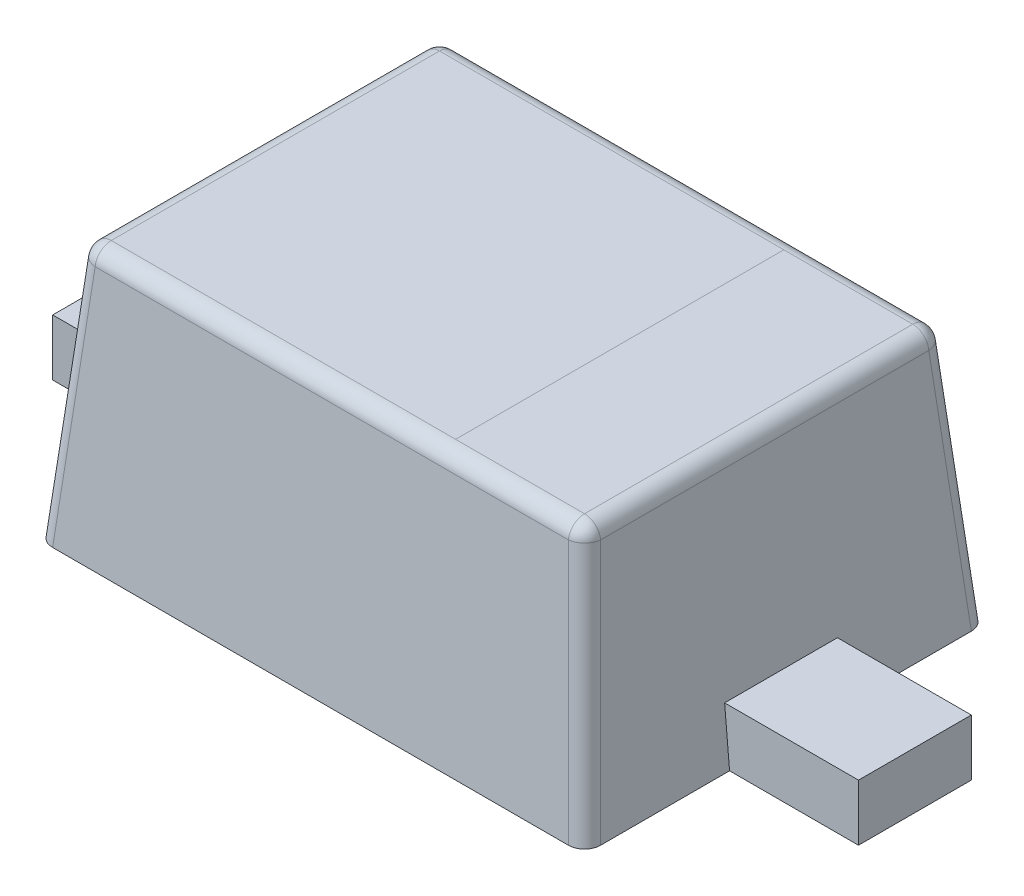
ISO-10303-21;
HEADER;
FILE_DESCRIPTION(('STEP AP214'),'2;1');
FILE_NAME('part.step','',(''),(''),'','','');
FILE_SCHEMA(('AUTOMOTIVE_DESIGN { 1 0 10303 214 1 1 1 1 }'));
ENDSEC;
DATA;
#1=APPLICATION_CONTEXT('core data for automotive mechanical design processes');
#2=APPLICATION_PROTOCOL_DEFINITION('international standard','automotive_design',2000,#1);
#3=PRODUCT_CONTEXT('',#1,'mechanical');
#4=PRODUCT('Part','Part','',(#3));
#5=PRODUCT_RELATED_PRODUCT_CATEGORY('part','',(#4));
#6=PRODUCT_DEFINITION_FORMATION('','',#4);
#7=PRODUCT_DEFINITION_CONTEXT('part definition',#1,'design');
#8=PRODUCT_DEFINITION('design','',#6,#7);
#9=PRODUCT_DEFINITION_SHAPE('','',#8);
#10=(LENGTH_UNIT() NAMED_UNIT(*) SI_UNIT(.MILLI.,.METRE.));
#11=(NAMED_UNIT(*) PLANE_ANGLE_UNIT() SI_UNIT($,.RADIAN.));
#12=(NAMED_UNIT(*) SI_UNIT($,.STERADIAN.) SOLID_ANGLE_UNIT());
#13=UNCERTAINTY_MEASURE_WITH_UNIT(LENGTH_MEASURE(1.E-05),#10,'distance_accuracy_value','');
#14=(GEOMETRIC_REPRESENTATION_CONTEXT(3) GLOBAL_UNCERTAINTY_ASSIGNED_CONTEXT((#13)) GLOBAL_UNIT_ASSIGNED_CONTEXT((#10,
#11,#12)) REPRESENTATION_CONTEXT('',''));
#15=CARTESIAN_POINT('',(0.,0.,0.));
#16=DIRECTION('',(0.,0.,1.));
#17=DIRECTION('',(1.,0.,0.));
#18=AXIS2_PLACEMENT_3D('',#15,#16,#17);
#19=CARTESIAN_POINT('',(-0.85,0.,0.625));
#20=DIRECTION('',(-0.996194698091746,0.0871557427476584,0.));
#21=DIRECTION('',(0.0617457854184492,0.705757556807952,0.705757556807952));
#22=AXIS2_PLACEMENT_3D('',#19,#20,#21);
#23=PLANE('',#22);
#24=DIRECTION('',(0.0871557427476584,0.996194698091745,0.));
#25=VECTOR('',#24,1.);
#26=CARTESIAN_POINT('',(-0.85,0.,0.175));
#27=LINE('',#26,#25);
#28=CARTESIAN_POINT('',(-0.85,0.,0.175));
#29=VERTEX_POINT('',#28);
#30=CARTESIAN_POINT('',(-0.834689483882963,0.175,0.175));
#31=VERTEX_POINT('',#30);
#32=EDGE_CURVE('E34',#29,#31,#27,.T.);
#33=ORIENTED_EDGE('',*,*,#32,.F.);
#34=DIRECTION('',(0.,0.,1.));
#35=VECTOR('',#34,1.);
#36=CARTESIAN_POINT('',(-0.85,0.,0.625));
#37=LINE('',#36,#35);
#38=CARTESIAN_POINT('',(-0.85,0.,0.575190265095413));
#39=VERTEX_POINT('',#38);
#40=EDGE_CURVE('E11',#29,#39,#37,.T.);
#41=ORIENTED_EDGE('',*,*,#40,.T.);
#42=DIRECTION('',(0.0868265938642478,0.992432509138967,-0.0868265938642478));
#43=VECTOR('',#42,1.);
#44=CARTESIAN_POINT('',(-0.850375508488681,-0.00429208166574834,0.575565773584093));
#45=LINE('',#44,#43);
#46=CARTESIAN_POINT('',(-0.784002245382977,0.754357787137383,0.50919251047839));
#47=VERTEX_POINT('',#46);
#48=EDGE_CURVE('E26',#39,#47,#45,.T.);
#49=ORIENTED_EDGE('',*,*,#48,.T.);
#50=DIRECTION('',(0.,0.,-1.));
#51=VECTOR('',#50,1.);
#52=CARTESIAN_POINT('',(-0.784002245382977,0.754357787137383,-0.555009069179261));
#53=LINE('',#52,#51);
#54=CARTESIAN_POINT('',(-0.784002245382977,0.754357787137383,-0.50919251047839));
#55=VERTEX_POINT('',#54);
#56=EDGE_CURVE('E317',#47,#55,#53,.T.);
#57=ORIENTED_EDGE('',*,*,#56,.T.);
#58=DIRECTION('',(-0.0868265938642478,-0.992432509138967,-0.0868265938642478));
#59=VECTOR('',#58,1.);
#60=CARTESIAN_POINT('',(-0.840951936736097,0.103419836345108,-0.56614220183151));
#61=LINE('',#60,#59);
#62=CARTESIAN_POINT('',(-0.85,0.,-0.575190265095413));
#63=VERTEX_POINT('',#62);
#64=EDGE_CURVE('E314',#55,#63,#61,.T.);
#65=ORIENTED_EDGE('',*,*,#64,.T.);
#66=DIRECTION('',(0.,0.,1.));
#67=VECTOR('',#66,1.);
#68=CARTESIAN_POINT('',(-0.85,0.,0.625));
#69=LINE('',#68,#67);
#70=CARTESIAN_POINT('',(-0.85,0.,-0.175));
#71=VERTEX_POINT('',#70);
#72=EDGE_CURVE('E310',#63,#71,#69,.T.);
#73=ORIENTED_EDGE('',*,*,#72,.T.);
#74=DIRECTION('',(-0.0871557427476584,-0.996194698091745,0.));
#75=VECTOR('',#74,1.);
#76=CARTESIAN_POINT('',(-0.85,0.,-0.175));
#77=LINE('',#76,#75);
#78=CARTESIAN_POINT('',(-0.834689483882963,0.175,-0.175));
#79=VERTEX_POINT('',#78);
#80=EDGE_CURVE('E166',#79,#71,#77,.T.);
#81=ORIENTED_EDGE('',*,*,#80,.F.);
#82=DIRECTION('',(0.,0.,1.));
#83=VECTOR('',#82,1.);
#84=CARTESIAN_POINT('',(-0.834689483882963,0.175,0.625));
#85=LINE('',#84,#83);
#86=EDGE_CURVE('E308',#79,#31,#85,.T.);
#87=ORIENTED_EDGE('',*,*,#86,.T.);
#88=EDGE_LOOP('',(#33,#41,#49,#57,#65,#73,#81,#87));
#89=FACE_BOUND('',#88,.T.);
#90=ADVANCED_FACE('F16',(#89),#23,.T.);
#91=CARTESIAN_POINT('',(0.85,0.,0.625));
#92=DIRECTION('',(0.996194698091746,0.0871557427476584,0.));
#93=DIRECTION('',(-0.0617457854184492,0.705757556807952,0.705757556807952));
#94=AXIS2_PLACEMENT_3D('',#91,#92,#93);
#95=PLANE('',#94);
#96=DIRECTION('',(0.0871557427476584,-0.996194698091745,0.));
#97=VECTOR('',#96,1.);
#98=CARTESIAN_POINT('',(0.85,0.,0.175));
#99=LINE('',#98,#97);
#100=CARTESIAN_POINT('',(0.834689483882963,0.175,0.175));
#101=VERTEX_POINT('',#100);
#102=CARTESIAN_POINT('',(0.85,0.,0.175));
#103=VERTEX_POINT('',#102);
#104=EDGE_CURVE('E191',#101,#103,#99,.T.);
#105=ORIENTED_EDGE('',*,*,#104,.F.);
#106=DIRECTION('',(0.,0.,-1.));
#107=VECTOR('',#106,1.);
#108=CARTESIAN_POINT('',(0.834689483882963,0.175,0.625));
#109=LINE('',#108,#107);
#110=CARTESIAN_POINT('',(0.834689483882963,0.175,-0.175));
#111=VERTEX_POINT('',#110);
#112=EDGE_CURVE('E304',#101,#111,#109,.T.);
#113=ORIENTED_EDGE('',*,*,#112,.T.);
#114=DIRECTION('',(-0.0871557427476584,0.996194698091745,0.));
#115=VECTOR('',#114,1.);
#116=CARTESIAN_POINT('',(0.85,0.,-0.175));
#117=LINE('',#116,#115);
#118=CARTESIAN_POINT('',(0.85,0.,-0.175));
#119=VERTEX_POINT('',#118);
#120=EDGE_CURVE('E190',#119,#111,#117,.T.);
#121=ORIENTED_EDGE('',*,*,#120,.F.);
#122=DIRECTION('',(0.,0.,-1.));
#123=VECTOR('',#122,1.);
#124=CARTESIAN_POINT('',(0.85,0.,0.625));
#125=LINE('',#124,#123);
#126=CARTESIAN_POINT('',(0.85,0.,-0.575190265095413));
#127=VERTEX_POINT('',#126);
#128=EDGE_CURVE('E301',#119,#127,#125,.T.);
#129=ORIENTED_EDGE('',*,*,#128,.T.);
#130=DIRECTION('',(-0.0868265938642478,0.992432509138967,0.0868265938642478));
#131=VECTOR('',#130,1.);
#132=CARTESIAN_POINT('',(0.840951936736097,0.103419836345108,-0.56614220183151));
#133=LINE('',#132,#131);
#134=CARTESIAN_POINT('',(0.784002245382977,0.754357787137383,-0.50919251047839));
#135=VERTEX_POINT('',#134);
#136=EDGE_CURVE('E298',#127,#135,#133,.T.);
#137=ORIENTED_EDGE('',*,*,#136,.T.);
#138=DIRECTION('',(0.,0.,1.));
#139=VECTOR('',#138,1.);
#140=CARTESIAN_POINT('',(0.784002245382977,0.754357787137383,0.555009069179261));
#141=LINE('',#140,#139);
#142=CARTESIAN_POINT('',(0.784002245382977,0.754357787137383,0.509192510478389));
#143=VERTEX_POINT('',#142);
#144=EDGE_CURVE('E295',#135,#143,#141,.T.);
#145=ORIENTED_EDGE('',*,*,#144,.T.);
#146=DIRECTION('',(0.0868265938642478,-0.992432509138967,0.0868265938642478));
#147=VECTOR('',#146,1.);
#148=CARTESIAN_POINT('',(0.850375508488681,-0.00429208166574833,0.575565773584093));
#149=LINE('',#148,#147);
#150=CARTESIAN_POINT('',(0.85,0.,0.575190265095413));
#151=VERTEX_POINT('',#150);
#152=EDGE_CURVE('E292',#143,#151,#149,.T.);
#153=ORIENTED_EDGE('',*,*,#152,.T.);
#154=DIRECTION('',(0.,0.,-1.));
#155=VECTOR('',#154,1.);
#156=CARTESIAN_POINT('',(0.85,0.,0.625));
#157=LINE('',#156,#155);
#158=EDGE_CURVE('E289',#151,#103,#157,.T.);
#159=ORIENTED_EDGE('',*,*,#158,.T.);
#160=EDGE_LOOP('',(#105,#113,#121,#129,#137,#145,#153,#159));
#161=FACE_BOUND('',#160,.T.);
#162=ADVANCED_FACE('F351',(#161),#95,.T.);
#163=CARTESIAN_POINT('',(0.,0.8,0.));
#164=DIRECTION('',(0.,1.,0.));
#165=DIRECTION('',(0.707106781186548,0.,0.707106781186548));
#166=AXIS2_PLACEMENT_3D('',#163,#164,#165);
#167=PLANE('',#166);
#168=DIRECTION('',(1.,0.,0.));
#169=VECTOR('',#168,1.);
#170=CARTESIAN_POINT('',(0.780009069179261,0.8,0.509192510478389));
#171=LINE('',#170,#169);
#172=CARTESIAN_POINT('',(-0.734192510478389,0.8,0.50919251047839));
#173=VERTEX_POINT('',#172);
#174=CARTESIAN_POINT('',(0.334192510478389,0.8,0.509192510478389));
#175=VERTEX_POINT('',#174);
#176=EDGE_CURVE('E286',#173,#175,#171,.T.);
#177=ORIENTED_EDGE('',*,*,#176,.T.);
#178=DIRECTION('',(0.,0.,-1.));
#179=VECTOR('',#178,1.);
#180=CARTESIAN_POINT('',(0.334192510478389,0.8,0.));
#181=LINE('',#180,#179);
#182=CARTESIAN_POINT('',(0.334192510478389,0.8,-0.50919251047839));
#183=VERTEX_POINT('',#182);
#184=EDGE_CURVE('E283',#175,#183,#181,.T.);
#185=ORIENTED_EDGE('',*,*,#184,.T.);
#186=DIRECTION('',(-1.,0.,0.));
#187=VECTOR('',#186,1.);
#188=CARTESIAN_POINT('',(-0.780009069179261,0.8,-0.50919251047839));
#189=LINE('',#188,#187);
#190=CARTESIAN_POINT('',(-0.734192510478389,0.8,-0.50919251047839));
#191=VERTEX_POINT('',#190);
#192=EDGE_CURVE('E280',#183,#191,#189,.T.);
#193=ORIENTED_EDGE('',*,*,#192,.T.);
#194=DIRECTION('',(0.,0.,1.));
#195=VECTOR('',#194,1.);
#196=CARTESIAN_POINT('',(-0.734192510478389,0.8,0.555009069179261));
#197=LINE('',#196,#195);
#198=EDGE_CURVE('E277',#191,#173,#197,.T.);
#199=ORIENTED_EDGE('',*,*,#198,.T.);
#200=EDGE_LOOP('',(#177,#185,#193,#199));
#201=FACE_BOUND('',#200,.T.);
#202=ADVANCED_FACE('F356',(#201),#167,.T.);
#203=CARTESIAN_POINT('',(0.85,0.,0.625));
#204=DIRECTION('',(0.,0.0871557427476584,0.996194698091746));
#205=DIRECTION('',(0.705757556807952,0.705757556807952,-0.0617457854184493));
#206=AXIS2_PLACEMENT_3D('',#203,#204,#205);
#207=PLANE('',#206);
#208=DIRECTION('',(-1.,0.,0.));
#209=VECTOR('',#208,1.);
#210=CARTESIAN_POINT('',(-0.780009069179261,0.754357787137383,0.559002245382977));
#211=LINE('',#210,#209);
#212=CARTESIAN_POINT('',(0.734192510478389,0.754357787137383,0.559002245382977));
#213=VERTEX_POINT('',#212);
#214=CARTESIAN_POINT('',(-0.734192510478389,0.754357787137383,0.559002245382977));
#215=VERTEX_POINT('',#214);
#216=EDGE_CURVE('E274',#213,#215,#211,.T.);
#217=ORIENTED_EDGE('',*,*,#216,.T.);
#218=DIRECTION('',(-0.0868265938642478,-0.992432509138967,0.0868265938642478));
#219=VECTOR('',#218,1.);
#220=CARTESIAN_POINT('',(-0.787749716000579,0.142196126829017,0.612559450905167));
#221=LINE('',#220,#219);
#222=CARTESIAN_POINT('',(-0.800190265095413,0.,0.625));
#223=VERTEX_POINT('',#222);
#224=EDGE_CURVE('E271',#215,#223,#221,.T.);
#225=ORIENTED_EDGE('',*,*,#224,.T.);
#226=DIRECTION('',(1.,0.,0.));
#227=VECTOR('',#226,1.);
#228=CARTESIAN_POINT('',(0.85,0.,0.625));
#229=LINE('',#228,#227);
#230=CARTESIAN_POINT('',(0.800190265095413,0.,0.625));
#231=VERTEX_POINT('',#230);
#232=EDGE_CURVE('E268',#223,#231,#229,.T.);
#233=ORIENTED_EDGE('',*,*,#232,.T.);
#234=DIRECTION('',(-0.0868265938642478,0.992432509138967,-0.0868265938642478));
#235=VECTOR('',#234,1.);
#236=CARTESIAN_POINT('',(0.800565773584093,-0.00429208166574833,0.62537550848868));
#237=LINE('',#236,#235);
#238=EDGE_CURVE('E265',#231,#213,#237,.T.);
#239=ORIENTED_EDGE('',*,*,#238,.T.);
#240=EDGE_LOOP('',(#217,#225,#233,#239));
#241=FACE_BOUND('',#240,.T.);
#242=ADVANCED_FACE('F362',(#241),#207,.T.);
#243=CARTESIAN_POINT('',(0.85,0.,-0.625));
#244=DIRECTION('',(0.,0.0871557427476584,-0.996194698091746));
#245=DIRECTION('',(0.705757556807952,0.705757556807952,0.0617457854184491));
#246=AXIS2_PLACEMENT_3D('',#243,#244,#245);
#247=PLANE('',#246);
#248=DIRECTION('',(-1.,0.,0.));
#249=VECTOR('',#248,1.);
#250=CARTESIAN_POINT('',(0.85,0.,-0.625));
#251=LINE('',#250,#249);
#252=CARTESIAN_POINT('',(0.800190265095413,0.,-0.625));
#253=VERTEX_POINT('',#252);
#254=CARTESIAN_POINT('',(-0.800190265095413,0.,-0.625));
#255=VERTEX_POINT('',#254);
#256=EDGE_CURVE('E262',#253,#255,#251,.T.);
#257=ORIENTED_EDGE('',*,*,#256,.T.);
#258=DIRECTION('',(0.0868265938642478,0.992432509138967,0.0868265938642478));
#259=VECTOR('',#258,1.);
#260=CARTESIAN_POINT('',(-0.787749716000579,0.142196126829017,-0.612559450905167));
#261=LINE('',#260,#259);
#262=CARTESIAN_POINT('',(-0.734192510478389,0.754357787137383,-0.559002245382977));
#263=VERTEX_POINT('',#262);
#264=EDGE_CURVE('E259',#255,#263,#261,.T.);
#265=ORIENTED_EDGE('',*,*,#264,.T.);
#266=DIRECTION('',(1.,0.,0.));
#267=VECTOR('',#266,1.);
#268=CARTESIAN_POINT('',(0.780009069179261,0.754357787137383,-0.559002245382977));
#269=LINE('',#268,#267);
#270=CARTESIAN_POINT('',(0.734192510478389,0.754357787137383,-0.559002245382977));
#271=VERTEX_POINT('',#270);
#272=EDGE_CURVE('E256',#263,#271,#269,.T.);
#273=ORIENTED_EDGE('',*,*,#272,.T.);
#274=DIRECTION('',(0.0868265938642478,-0.992432509138967,-0.0868265938642478));
#275=VECTOR('',#274,1.);
#276=CARTESIAN_POINT('',(0.800565773584093,-0.00429208166574834,-0.625375508488681));
#277=LINE('',#276,#275);
#278=EDGE_CURVE('E254',#271,#253,#277,.T.);
#279=ORIENTED_EDGE('',*,*,#278,.T.);
#280=EDGE_LOOP('',(#257,#265,#273,#279));
#281=FACE_BOUND('',#280,.T.);
#282=ADVANCED_FACE('F366',(#281),#247,.T.);
#283=CARTESIAN_POINT('',(0.,0.8,0.));
#284=DIRECTION('',(0.,1.,0.));
#285=DIRECTION('',(0.707106781186548,0.,0.707106781186548));
#286=AXIS2_PLACEMENT_3D('',#283,#284,#285);
#287=PLANE('',#286);
#288=ORIENTED_EDGE('',*,*,#184,.F.);
#289=DIRECTION('',(1.,0.,0.));
#290=VECTOR('',#289,1.);
#291=CARTESIAN_POINT('',(0.780009069179261,0.8,0.509192510478389));
#292=LINE('',#291,#290);
#293=CARTESIAN_POINT('',(0.734192510478389,0.8,0.509192510478389));
#294=VERTEX_POINT('',#293);
#295=EDGE_CURVE('E251',#175,#294,#292,.T.);
#296=ORIENTED_EDGE('',*,*,#295,.T.);
#297=DIRECTION('',(0.,0.,-1.));
#298=VECTOR('',#297,1.);
#299=CARTESIAN_POINT('',(0.734192510478389,0.8,-0.555009069179261));
#300=LINE('',#299,#298);
#301=CARTESIAN_POINT('',(0.734192510478389,0.8,-0.50919251047839));
#302=VERTEX_POINT('',#301);
#303=EDGE_CURVE('E248',#294,#302,#300,.T.);
#304=ORIENTED_EDGE('',*,*,#303,.T.);
#305=DIRECTION('',(-1.,0.,0.));
#306=VECTOR('',#305,1.);
#307=CARTESIAN_POINT('',(-0.780009069179261,0.8,-0.50919251047839));
#308=LINE('',#307,#306);
#309=EDGE_CURVE('E240',#302,#183,#308,.T.);
#310=ORIENTED_EDGE('',*,*,#309,.T.);
#311=EDGE_LOOP('',(#288,#296,#304,#310));
#312=FACE_BOUND('',#311,.T.);
#313=ADVANCED_FACE('F370',(#312),#287,.T.);
#314=CARTESIAN_POINT('',(0.,0.,0.));
#315=DIRECTION('',(0.,1.,0.));
#316=DIRECTION('',(0.707106781186548,0.,0.707106781186548));
#317=AXIS2_PLACEMENT_3D('',#314,#315,#316);
#318=PLANE('',#317);
#319=ORIENTED_EDGE('',*,*,#128,.F.);
#320=DIRECTION('',(-1.,0.,0.));
#321=VECTOR('',#320,1.);
#322=CARTESIAN_POINT('',(1.25,0.,-0.175));
#323=LINE('',#322,#321);
#324=CARTESIAN_POINT('',(1.25,0.,-0.175));
#325=VERTEX_POINT('',#324);
#326=EDGE_CURVE('E177',#325,#119,#323,.T.);
#327=ORIENTED_EDGE('',*,*,#326,.F.);
#328=DIRECTION('',(0.,0.,-1.));
#329=VECTOR('',#328,1.);
#330=CARTESIAN_POINT('',(1.25,0.,0.175));
#331=LINE('',#330,#329);
#332=CARTESIAN_POINT('',(1.25,0.,0.175));
#333=VERTEX_POINT('',#332);
#334=EDGE_CURVE('E184',#333,#325,#331,.T.);
#335=ORIENTED_EDGE('',*,*,#334,.F.);
#336=DIRECTION('',(1.,0.,0.));
#337=VECTOR('',#336,1.);
#338=CARTESIAN_POINT('',(1.25,0.,0.175));
#339=LINE('',#338,#337);
#340=EDGE_CURVE('E172',#103,#333,#339,.T.);
#341=ORIENTED_EDGE('',*,*,#340,.F.);
#342=ORIENTED_EDGE('',*,*,#158,.F.);
#343=CARTESIAN_POINT('',(0.799809008122833,0.,0.574809008122832));
#344=DIRECTION('',(0.,-1.,0.));
#345=DIRECTION('',(0.707106781186547,0.,0.707106781186548));
#346=AXIS2_PLACEMENT_3D('',#343,#344,#345);
#347=ELLIPSE('',#346,0.0503812597225175,0.05);
#348=EDGE_CURVE('E237',#151,#231,#347,.T.);
#349=ORIENTED_EDGE('',*,*,#348,.T.);
#350=ORIENTED_EDGE('',*,*,#232,.F.);
#351=CARTESIAN_POINT('',(-0.799809008122833,0.,0.574809008122833));
#352=DIRECTION('',(0.,-1.,0.));
#353=DIRECTION('',(0.707106781186548,0.,-0.707106781186547));
#354=AXIS2_PLACEMENT_3D('',#351,#352,#353);
#355=ELLIPSE('',#354,0.0503812597225175,0.05);
#356=EDGE_CURVE('E230',#223,#39,#355,.T.);
#357=ORIENTED_EDGE('',*,*,#356,.T.);
#358=ORIENTED_EDGE('',*,*,#40,.F.);
#359=DIRECTION('',(1.,0.,0.));
#360=VECTOR('',#359,1.);
#361=CARTESIAN_POINT('',(1.25,0.,0.175));
#362=LINE('',#361,#360);
#363=CARTESIAN_POINT('',(-1.25,0.,0.175));
#364=VERTEX_POINT('',#363);
#365=EDGE_CURVE('E157',#364,#29,#362,.T.);
#366=ORIENTED_EDGE('',*,*,#365,.F.);
#367=DIRECTION('',(0.,0.,1.));
#368=VECTOR('',#367,1.);
#369=CARTESIAN_POINT('',(-1.25,0.,0.175));
#370=LINE('',#369,#368);
#371=CARTESIAN_POINT('',(-1.25,0.,-0.175));
#372=VERTEX_POINT('',#371);
#373=EDGE_CURVE('E164',#372,#364,#370,.T.);
#374=ORIENTED_EDGE('',*,*,#373,.F.);
#375=DIRECTION('',(-1.,0.,0.));
#376=VECTOR('',#375,1.);
#377=CARTESIAN_POINT('',(1.25,0.,-0.175));
#378=LINE('',#377,#376);
#379=EDGE_CURVE('E168',#71,#372,#378,.T.);
#380=ORIENTED_EDGE('',*,*,#379,.F.);
#381=ORIENTED_EDGE('',*,*,#72,.F.);
#382=CARTESIAN_POINT('',(-0.799809008122833,0.,-0.574809008122833));
#383=DIRECTION('',(0.,-1.,0.));
#384=DIRECTION('',(0.707106781186547,0.,0.707106781186548));
#385=AXIS2_PLACEMENT_3D('',#382,#383,#384);
#386=ELLIPSE('',#385,0.0503812597225175,0.05);
#387=EDGE_CURVE('E227',#63,#255,#386,.T.);
#388=ORIENTED_EDGE('',*,*,#387,.T.);
#389=ORIENTED_EDGE('',*,*,#256,.F.);
#390=CARTESIAN_POINT('',(0.799809008122833,0.,-0.574809008122833));
#391=DIRECTION('',(0.,-1.,0.));
#392=DIRECTION('',(0.707106781186548,0.,-0.707106781186547));
#393=AXIS2_PLACEMENT_3D('',#390,#391,#392);
#394=ELLIPSE('',#393,0.0503812597225175,0.05);
#395=EDGE_CURVE('E222',#253,#127,#394,.T.);
#396=ORIENTED_EDGE('',*,*,#395,.T.);
#397=EDGE_LOOP('',(#319,#327,#335,#341,#342,#349,#350,#357,#358,#366,#374,#380,#381,#388,#389,#396));
#398=FACE_BOUND('',#397,.T.);
#399=ADVANCED_FACE('F340',(#398),#318,.F.);
#400=CARTESIAN_POINT('',(0.800565773584093,-0.00864986880313126,0.575565773584093));
#401=DIRECTION('',(0.0868265938642478,-0.992432509138967,0.0868265938642478));
#402=DIRECTION('',(0.996194698091746,0.0871557427476584,0.));
#403=AXIS2_PLACEMENT_3D('',#400,#401,#402);
#404=CYLINDRICAL_SURFACE('',#403,0.05);
#405=ORIENTED_EDGE('',*,*,#348,.F.);
#406=ORIENTED_EDGE('',*,*,#152,.F.);
#407=CARTESIAN_POINT('',(0.734192510478389,0.75,0.509192510478389));
#408=DIRECTION('',(-0.0868265938642477,0.992432509138967,-0.0868265938642477));
#409=DIRECTION('',(0.,0.0871557427476582,0.996194698091746));
#410=AXIS2_PLACEMENT_3D('',#407,#408,#409);
#411=CIRCLE('',#410,0.05);
#412=EDGE_CURVE('E218',#213,#143,#411,.T.);
#413=ORIENTED_EDGE('',*,*,#412,.F.);
#414=ORIENTED_EDGE('',*,*,#238,.F.);
#415=EDGE_LOOP('',(#405,#406,#413,#414));
#416=FACE_BOUND('',#415,.T.);
#417=ADVANCED_FACE('F377',(#416),#404,.T.);
#418=CARTESIAN_POINT('',(0.,0.75,0.509192510478389));
#419=DIRECTION('',(1.,0.,0.));
#420=DIRECTION('',(0.,0.,-1.));
#421=AXIS2_PLACEMENT_3D('',#418,#419,#420);
#422=CYLINDRICAL_SURFACE('',#421,0.05);
#423=CARTESIAN_POINT('',(-0.734192510478389,0.75,0.50919251047839));
#424=DIRECTION('',(-1.,0.,0.));
#425=DIRECTION('',(0.,0.,1.));
#426=AXIS2_PLACEMENT_3D('',#423,#424,#425);
#427=CIRCLE('',#426,0.05);
#428=EDGE_CURVE('E214',#215,#173,#427,.T.);
#429=ORIENTED_EDGE('',*,*,#428,.F.);
#430=ORIENTED_EDGE('',*,*,#216,.F.);
#431=CARTESIAN_POINT('',(0.734192510478389,0.75,0.509192510478389));
#432=DIRECTION('',(1.,0.,0.));
#433=DIRECTION('',(0.,0.,-1.));
#434=AXIS2_PLACEMENT_3D('',#431,#432,#433);
#435=CIRCLE('',#434,0.05);
#436=EDGE_CURVE('E219',#294,#213,#435,.T.);
#437=ORIENTED_EDGE('',*,*,#436,.F.);
#438=ORIENTED_EDGE('',*,*,#295,.F.);
#439=ORIENTED_EDGE('',*,*,#176,.F.);
#440=EDGE_LOOP('',(#429,#430,#437,#438,#439));
#441=FACE_BOUND('',#440,.T.);
#442=ADVANCED_FACE('F380',(#441),#422,.T.);
#443=CARTESIAN_POINT('',(-0.787749716000579,0.137838339691634,0.562749716000579));
#444=DIRECTION('',(-0.0868265938642478,-0.992432509138967,0.0868265938642478));
#445=DIRECTION('',(0.,-0.0871557427476584,-0.996194698091746));
#446=AXIS2_PLACEMENT_3D('',#443,#444,#445);
#447=CYLINDRICAL_SURFACE('',#446,0.05);
#448=ORIENTED_EDGE('',*,*,#356,.F.);
#449=ORIENTED_EDGE('',*,*,#224,.F.);
#450=CARTESIAN_POINT('',(-0.734192510478389,0.75,0.50919251047839));
#451=DIRECTION('',(0.0868265938642477,0.992432509138967,-0.0868265938642475));
#452=DIRECTION('',(-0.996194698091746,0.0871557427476582,0.));
#453=AXIS2_PLACEMENT_3D('',#450,#451,#452);
#454=CIRCLE('',#453,0.05);
#455=EDGE_CURVE('E215',#47,#215,#454,.T.);
#456=ORIENTED_EDGE('',*,*,#455,.F.);
#457=ORIENTED_EDGE('',*,*,#48,.F.);
#458=EDGE_LOOP('',(#448,#449,#456,#457));
#459=FACE_BOUND('',#458,.T.);
#460=ADVANCED_FACE('F384',(#459),#447,.T.);
#461=CARTESIAN_POINT('',(0.734192510478389,0.75,0.509192510478389));
#462=DIRECTION('',(0.,0.,1.));
#463=DIRECTION('',(1.,0.,0.));
#464=AXIS2_PLACEMENT_3D('',#461,#462,#463);
#465=SPHERICAL_SURFACE('',#464,0.05);
#466=ORIENTED_EDGE('',*,*,#436,.T.);
#467=ORIENTED_EDGE('',*,*,#412,.T.);
#468=CARTESIAN_POINT('',(0.734192510478389,0.75,0.509192510478389));
#469=DIRECTION('',(0.,0.,-1.));
#470=DIRECTION('',(0.,-1.,0.));
#471=AXIS2_PLACEMENT_3D('',#468,#469,#470);
#472=CIRCLE('',#471,0.05);
#473=EDGE_CURVE('E211',#294,#143,#472,.T.);
#474=ORIENTED_EDGE('',*,*,#473,.F.);
#475=EDGE_LOOP('',(#466,#467,#474));
#476=FACE_BOUND('',#475,.T.);
#477=ADVANCED_FACE('F388',(#476),#465,.T.);
#478=CARTESIAN_POINT('',(-0.734192510478389,0.75,0.50919251047839));
#479=DIRECTION('',(0.,0.,1.));
#480=DIRECTION('',(1.,0.,0.));
#481=AXIS2_PLACEMENT_3D('',#478,#479,#480);
#482=SPHERICAL_SURFACE('',#481,0.05);
#483=ORIENTED_EDGE('',*,*,#455,.T.);
#484=ORIENTED_EDGE('',*,*,#428,.T.);
#485=CARTESIAN_POINT('',(-0.734192510478389,0.75,0.50919251047839));
#486=DIRECTION('',(0.,0.,-1.));
#487=DIRECTION('',(1.,0.,0.));
#488=AXIS2_PLACEMENT_3D('',#485,#486,#487);
#489=CIRCLE('',#488,0.05);
#490=EDGE_CURVE('E207',#47,#173,#489,.T.);
#491=ORIENTED_EDGE('',*,*,#490,.F.);
#492=EDGE_LOOP('',(#483,#484,#491));
#493=FACE_BOUND('',#492,.T.);
#494=ADVANCED_FACE('F326',(#493),#482,.T.);
#495=CARTESIAN_POINT('',(0.800565773584093,-0.00864986880313126,-0.575565773584093));
#496=DIRECTION('',(0.0868265938642478,-0.992432509138967,-0.0868265938642478));
#497=DIRECTION('',(0.,0.0871557427476584,-0.996194698091746));
#498=AXIS2_PLACEMENT_3D('',#495,#496,#497);
#499=CYLINDRICAL_SURFACE('',#498,0.05);
#500=ORIENTED_EDGE('',*,*,#395,.F.);
#501=ORIENTED_EDGE('',*,*,#278,.F.);
#502=CARTESIAN_POINT('',(0.734192510478389,0.75,-0.50919251047839));
#503=DIRECTION('',(-0.0868265938642477,0.992432509138967,0.0868265938642475));
#504=DIRECTION('',(-0.996194698091746,-0.0871557427476582,0.));
#505=AXIS2_PLACEMENT_3D('',#502,#503,#504);
#506=CIRCLE('',#505,0.05);
#507=EDGE_CURVE('E202',#135,#271,#506,.T.);
#508=ORIENTED_EDGE('',*,*,#507,.F.);
#509=ORIENTED_EDGE('',*,*,#136,.F.);
#510=EDGE_LOOP('',(#500,#501,#508,#509));
#511=FACE_BOUND('',#510,.T.);
#512=ADVANCED_FACE('F394',(#511),#499,.T.);
#513=CARTESIAN_POINT('',(0.734192510478389,0.75,0.));
#514=DIRECTION('',(0.,0.,-1.));
#515=DIRECTION('',(-1.,0.,0.));
#516=AXIS2_PLACEMENT_3D('',#513,#514,#515);
#517=CYLINDRICAL_SURFACE('',#516,0.05);
#518=ORIENTED_EDGE('',*,*,#473,.T.);
#519=ORIENTED_EDGE('',*,*,#144,.F.);
#520=CARTESIAN_POINT('',(0.734192510478389,0.75,-0.50919251047839));
#521=DIRECTION('',(0.,0.,-1.));
#522=DIRECTION('',(-1.,0.,0.));
#523=AXIS2_PLACEMENT_3D('',#520,#521,#522);
#524=CIRCLE('',#523,0.05);
#525=EDGE_CURVE('E204',#302,#135,#524,.T.);
#526=ORIENTED_EDGE('',*,*,#525,.F.);
#527=ORIENTED_EDGE('',*,*,#303,.F.);
#528=EDGE_LOOP('',(#518,#519,#526,#527));
#529=FACE_BOUND('',#528,.T.);
#530=ADVANCED_FACE('F397',(#529),#517,.T.);
#531=CARTESIAN_POINT('',(-0.734192510478389,0.75,0.));
#532=DIRECTION('',(0.,0.,1.));
#533=DIRECTION('',(1.,0.,0.));
#534=AXIS2_PLACEMENT_3D('',#531,#532,#533);
#535=CYLINDRICAL_SURFACE('',#534,0.05);
#536=ORIENTED_EDGE('',*,*,#490,.T.);
#537=ORIENTED_EDGE('',*,*,#198,.F.);
#538=CARTESIAN_POINT('',(-0.734192510478389,0.75,-0.50919251047839));
#539=DIRECTION('',(0.,0.,-1.));
#540=DIRECTION('',(0.,1.,0.));
#541=AXIS2_PLACEMENT_3D('',#538,#539,#540);
#542=CIRCLE('',#541,0.05);
#543=EDGE_CURVE('E198',#55,#191,#542,.T.);
#544=ORIENTED_EDGE('',*,*,#543,.F.);
#545=ORIENTED_EDGE('',*,*,#56,.F.);
#546=EDGE_LOOP('',(#536,#537,#544,#545));
#547=FACE_BOUND('',#546,.T.);
#548=ADVANCED_FACE('F329',(#547),#535,.T.);
#549=CARTESIAN_POINT('',(-0.791142201831509,0.0990620492077256,-0.56614220183151));
#550=DIRECTION('',(-0.0868265938642478,-0.992432509138967,-0.0868265938642478));
#551=DIRECTION('',(0.996194698091746,-0.0871557427476584,0.));
#552=AXIS2_PLACEMENT_3D('',#549,#550,#551);
#553=CYLINDRICAL_SURFACE('',#552,0.05);
#554=ORIENTED_EDGE('',*,*,#387,.F.);
#555=ORIENTED_EDGE('',*,*,#64,.F.);
#556=CARTESIAN_POINT('',(-0.734192510478389,0.75,-0.50919251047839));
#557=DIRECTION('',(0.0868265938642473,0.992432509138967,0.0868265938642477));
#558=DIRECTION('',(0.,-0.0871557427476582,0.996194698091746));
#559=AXIS2_PLACEMENT_3D('',#556,#557,#558);
#560=CIRCLE('',#559,0.05);
#561=EDGE_CURVE('E199',#263,#55,#560,.T.);
#562=ORIENTED_EDGE('',*,*,#561,.F.);
#563=ORIENTED_EDGE('',*,*,#264,.F.);
#564=EDGE_LOOP('',(#554,#555,#562,#563));
#565=FACE_BOUND('',#564,.T.);
#566=ADVANCED_FACE('F335',(#565),#553,.T.);
#567=CARTESIAN_POINT('',(0.734192510478389,0.75,-0.50919251047839));
#568=DIRECTION('',(0.,0.,1.));
#569=DIRECTION('',(1.,0.,0.));
#570=AXIS2_PLACEMENT_3D('',#567,#568,#569);
#571=SPHERICAL_SURFACE('',#570,0.05);
#572=ORIENTED_EDGE('',*,*,#525,.T.);
#573=ORIENTED_EDGE('',*,*,#507,.T.);
#574=CARTESIAN_POINT('',(0.734192510478389,0.75,-0.50919251047839));
#575=DIRECTION('',(-1.,0.,0.));
#576=DIRECTION('',(0.,0.,-1.));
#577=AXIS2_PLACEMENT_3D('',#574,#575,#576);
#578=CIRCLE('',#577,0.05);
#579=EDGE_CURVE('E195',#302,#271,#578,.T.);
#580=ORIENTED_EDGE('',*,*,#579,.F.);
#581=EDGE_LOOP('',(#572,#573,#580));
#582=FACE_BOUND('',#581,.T.);
#583=ADVANCED_FACE('F406',(#582),#571,.T.);
#584=CARTESIAN_POINT('',(-0.734192510478389,0.75,-0.50919251047839));
#585=DIRECTION('',(0.,0.,1.));
#586=DIRECTION('',(1.,0.,0.));
#587=AXIS2_PLACEMENT_3D('',#584,#585,#586);
#588=SPHERICAL_SURFACE('',#587,0.05);
#589=ORIENTED_EDGE('',*,*,#561,.T.);
#590=ORIENTED_EDGE('',*,*,#543,.T.);
#591=CARTESIAN_POINT('',(-0.734192510478389,0.75,-0.50919251047839));
#592=DIRECTION('',(1.,0.,0.));
#593=DIRECTION('',(0.,0.,1.));
#594=AXIS2_PLACEMENT_3D('',#591,#592,#593);
#595=CIRCLE('',#594,0.05);
#596=EDGE_CURVE('E192',#263,#191,#595,.T.);
#597=ORIENTED_EDGE('',*,*,#596,.F.);
#598=EDGE_LOOP('',(#589,#590,#597));
#599=FACE_BOUND('',#598,.T.);
#600=ADVANCED_FACE('F409',(#599),#588,.T.);
#601=CARTESIAN_POINT('',(0.,0.75,-0.50919251047839));
#602=DIRECTION('',(-1.,0.,0.));
#603=DIRECTION('',(0.,0.,1.));
#604=AXIS2_PLACEMENT_3D('',#601,#602,#603);
#605=CYLINDRICAL_SURFACE('',#604,0.05);
#606=ORIENTED_EDGE('',*,*,#579,.T.);
#607=ORIENTED_EDGE('',*,*,#272,.F.);
#608=ORIENTED_EDGE('',*,*,#596,.T.);
#609=ORIENTED_EDGE('',*,*,#192,.F.);
#610=ORIENTED_EDGE('',*,*,#309,.F.);
#611=EDGE_LOOP('',(#606,#607,#608,#609,#610));
#612=FACE_BOUND('',#611,.T.);
#613=ADVANCED_FACE('F413',(#612),#605,.T.);
#614=CARTESIAN_POINT('',(1.25,0.175,0.175));
#615=DIRECTION('',(-1.,0.,0.));
#616=DIRECTION('',(0.,0.707106781186548,0.707106781186548));
#617=AXIS2_PLACEMENT_3D('',#614,#615,#616);
#618=PLANE('',#617);
#619=ORIENTED_EDGE('',*,*,#334,.T.);
#620=DIRECTION('',(0.,-1.,0.));
#621=VECTOR('',#620,1.);
#622=CARTESIAN_POINT('',(1.25,0.175,-0.175));
#623=LINE('',#622,#621);
#624=CARTESIAN_POINT('',(1.25,0.175,-0.175));
#625=VERTEX_POINT('',#624);
#626=EDGE_CURVE('E187',#625,#325,#623,.T.);
#627=ORIENTED_EDGE('',*,*,#626,.F.);
#628=DIRECTION('',(0.,0.,-1.));
#629=VECTOR('',#628,1.);
#630=CARTESIAN_POINT('',(1.25,0.175,0.175));
#631=LINE('',#630,#629);
#632=CARTESIAN_POINT('',(1.25,0.175,0.175));
#633=VERTEX_POINT('',#632);
#634=EDGE_CURVE('E176',#633,#625,#631,.T.);
#635=ORIENTED_EDGE('',*,*,#634,.F.);
#636=DIRECTION('',(0.,-1.,0.));
#637=VECTOR('',#636,1.);
#638=CARTESIAN_POINT('',(1.25,0.175,0.175));
#639=LINE('',#638,#637);
#640=EDGE_CURVE('E181',#633,#333,#639,.T.);
#641=ORIENTED_EDGE('',*,*,#640,.T.);
#642=EDGE_LOOP('',(#619,#627,#635,#641));
#643=FACE_BOUND('',#642,.T.);
#644=ADVANCED_FACE('F416',(#643),#618,.F.);
#645=CARTESIAN_POINT('',(0.,0.175,0.));
#646=DIRECTION('',(0.,1.,0.));
#647=DIRECTION('',(0.707106781186548,0.,0.707106781186548));
#648=AXIS2_PLACEMENT_3D('',#645,#646,#647);
#649=PLANE('',#648);
#650=ORIENTED_EDGE('',*,*,#112,.F.);
#651=DIRECTION('',(1.,0.,0.));
#652=VECTOR('',#651,1.);
#653=CARTESIAN_POINT('',(1.25,0.175,0.175));
#654=LINE('',#653,#652);
#655=EDGE_CURVE('E178',#101,#633,#654,.T.);
#656=ORIENTED_EDGE('',*,*,#655,.T.);
#657=ORIENTED_EDGE('',*,*,#634,.T.);
#658=DIRECTION('',(-1.,0.,0.));
#659=VECTOR('',#658,1.);
#660=CARTESIAN_POINT('',(1.25,0.175,-0.175));
#661=LINE('',#660,#659);
#662=EDGE_CURVE('E173',#625,#111,#661,.T.);
#663=ORIENTED_EDGE('',*,*,#662,.T.);
#664=EDGE_LOOP('',(#650,#656,#657,#663));
#665=FACE_BOUND('',#664,.T.);
#666=ADVANCED_FACE('F420',(#665),#649,.T.);
#667=CARTESIAN_POINT('',(1.25,0.175,-0.175));
#668=DIRECTION('',(0.,0.,1.));
#669=DIRECTION('',(0.707106781186548,0.707106781186548,0.));
#670=AXIS2_PLACEMENT_3D('',#667,#668,#669);
#671=PLANE('',#670);
#672=ORIENTED_EDGE('',*,*,#326,.T.);
#673=ORIENTED_EDGE('',*,*,#120,.T.);
#674=ORIENTED_EDGE('',*,*,#662,.F.);
#675=ORIENTED_EDGE('',*,*,#626,.T.);
#676=EDGE_LOOP('',(#672,#673,#674,#675));
#677=FACE_BOUND('',#676,.T.);
#678=ADVANCED_FACE('F424',(#677),#671,.F.);
#679=CARTESIAN_POINT('',(1.25,0.175,0.175));
#680=DIRECTION('',(0.,0.,-1.));
#681=DIRECTION('',(0.707106781186548,0.707106781186548,0.));
#682=AXIS2_PLACEMENT_3D('',#679,#680,#681);
#683=PLANE('',#682);
#684=ORIENTED_EDGE('',*,*,#655,.F.);
#685=ORIENTED_EDGE('',*,*,#104,.T.);
#686=ORIENTED_EDGE('',*,*,#340,.T.);
#687=ORIENTED_EDGE('',*,*,#640,.F.);
#688=EDGE_LOOP('',(#684,#685,#686,#687));
#689=FACE_BOUND('',#688,.T.);
#690=ADVANCED_FACE('F428',(#689),#683,.F.);
#691=CARTESIAN_POINT('',(0.,0.175,0.));
#692=DIRECTION('',(0.,1.,0.));
#693=DIRECTION('',(0.707106781186548,0.,0.707106781186548));
#694=AXIS2_PLACEMENT_3D('',#691,#692,#693);
#695=PLANE('',#694);
#696=ORIENTED_EDGE('',*,*,#86,.F.);
#697=DIRECTION('',(-1.,0.,0.));
#698=VECTOR('',#697,1.);
#699=CARTESIAN_POINT('',(1.25,0.175,-0.175));
#700=LINE('',#699,#698);
#701=CARTESIAN_POINT('',(-1.25,0.175,-0.175));
#702=VERTEX_POINT('',#701);
#703=EDGE_CURVE('E161',#79,#702,#700,.T.);
#704=ORIENTED_EDGE('',*,*,#703,.T.);
#705=DIRECTION('',(0.,0.,1.));
#706=VECTOR('',#705,1.);
#707=CARTESIAN_POINT('',(-1.25,0.175,0.175));
#708=LINE('',#707,#706);
#709=CARTESIAN_POINT('',(-1.25,0.175,0.175));
#710=VERTEX_POINT('',#709);
#711=EDGE_CURVE('E145',#702,#710,#708,.T.);
#712=ORIENTED_EDGE('',*,*,#711,.T.);
#713=DIRECTION('',(1.,0.,0.));
#714=VECTOR('',#713,1.);
#715=CARTESIAN_POINT('',(1.25,0.175,0.175));
#716=LINE('',#715,#714);
#717=EDGE_CURVE('E151',#710,#31,#716,.T.);
#718=ORIENTED_EDGE('',*,*,#717,.T.);
#719=EDGE_LOOP('',(#696,#704,#712,#718));
#720=FACE_BOUND('',#719,.T.);
#721=ADVANCED_FACE('F159',(#720),#695,.T.);
#722=CARTESIAN_POINT('',(1.25,0.175,0.175));
#723=DIRECTION('',(0.,0.,-1.));
#724=DIRECTION('',(0.707106781186548,0.707106781186548,0.));
#725=AXIS2_PLACEMENT_3D('',#722,#723,#724);
#726=PLANE('',#725);
#727=ORIENTED_EDGE('',*,*,#365,.T.);
#728=ORIENTED_EDGE('',*,*,#32,.T.);
#729=ORIENTED_EDGE('',*,*,#717,.F.);
#730=DIRECTION('',(0.,-1.,0.));
#731=VECTOR('',#730,1.);
#732=CARTESIAN_POINT('',(-1.25,0.175,0.175));
#733=LINE('',#732,#731);
#734=EDGE_CURVE('E154',#710,#364,#733,.T.);
#735=ORIENTED_EDGE('',*,*,#734,.T.);
#736=EDGE_LOOP('',(#727,#728,#729,#735));
#737=FACE_BOUND('',#736,.T.);
#738=ADVANCED_FACE('F153',(#737),#726,.F.);
#739=CARTESIAN_POINT('',(1.25,0.175,-0.175));
#740=DIRECTION('',(0.,0.,1.));
#741=DIRECTION('',(0.707106781186548,0.707106781186548,0.));
#742=AXIS2_PLACEMENT_3D('',#739,#740,#741);
#743=PLANE('',#742);
#744=ORIENTED_EDGE('',*,*,#703,.F.);
#745=ORIENTED_EDGE('',*,*,#80,.T.);
#746=ORIENTED_EDGE('',*,*,#379,.T.);
#747=DIRECTION('',(0.,-1.,0.));
#748=VECTOR('',#747,1.);
#749=CARTESIAN_POINT('',(-1.25,0.175,-0.175));
#750=LINE('',#749,#748);
#751=EDGE_CURVE('E20',#702,#372,#750,.T.);
#752=ORIENTED_EDGE('',*,*,#751,.F.);
#753=EDGE_LOOP('',(#744,#745,#746,#752));
#754=FACE_BOUND('',#753,.T.);
#755=ADVANCED_FACE('F342',(#754),#743,.F.);
#756=CARTESIAN_POINT('',(-1.25,0.175,0.175));
#757=DIRECTION('',(1.,0.,0.));
#758=DIRECTION('',(0.,0.707106781186548,0.707106781186548));
#759=AXIS2_PLACEMENT_3D('',#756,#757,#758);
#760=PLANE('',#759);
#761=ORIENTED_EDGE('',*,*,#373,.T.);
#762=ORIENTED_EDGE('',*,*,#734,.F.);
#763=ORIENTED_EDGE('',*,*,#711,.F.);
#764=ORIENTED_EDGE('',*,*,#751,.T.);
#765=EDGE_LOOP('',(#761,#762,#763,#764));
#766=FACE_BOUND('',#765,.T.);
#767=ADVANCED_FACE('F18',(#766),#760,.F.);
#768=CLOSED_SHELL('',(#90,#162,#202,#242,#282,#313,#399,#417,#442,#460,#477,#494,#512,#530,#548,
#566,#583,#600,#613,#644,#666,#678,#690,#721,#738,#755,#767));
#769=MANIFOLD_SOLID_BREP('B1',#768);
#770=ADVANCED_BREP_SHAPE_REPRESENTATION('',(#18,#769),#14);
#771=SHAPE_DEFINITION_REPRESENTATION(#9,#770);
ENDSEC;
END-ISO-10303-21;
